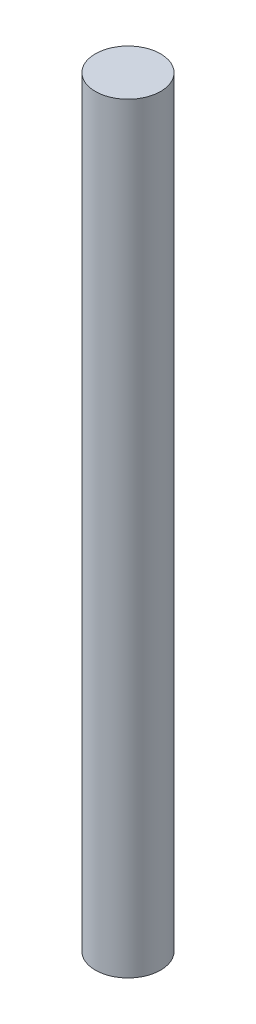
ISO-10303-21;
HEADER;
FILE_DESCRIPTION(('STEP AP214'),'2;1');
FILE_NAME('part.step','',(''),(''),'','','');
FILE_SCHEMA(('AUTOMOTIVE_DESIGN { 1 0 10303 214 1 1 1 1 }'));
ENDSEC;
DATA;
#1=APPLICATION_CONTEXT('core data for automotive mechanical design processes');
#2=APPLICATION_PROTOCOL_DEFINITION('international standard','automotive_design',2000,#1);
#3=PRODUCT_CONTEXT('',#1,'mechanical');
#4=PRODUCT('Part','Part','',(#3));
#5=PRODUCT_RELATED_PRODUCT_CATEGORY('part','',(#4));
#6=PRODUCT_DEFINITION_FORMATION('','',#4);
#7=PRODUCT_DEFINITION_CONTEXT('part definition',#1,'design');
#8=PRODUCT_DEFINITION('design','',#6,#7);
#9=PRODUCT_DEFINITION_SHAPE('','',#8);
#10=(LENGTH_UNIT() NAMED_UNIT(*) SI_UNIT(.MILLI.,.METRE.));
#11=(NAMED_UNIT(*) PLANE_ANGLE_UNIT() SI_UNIT($,.RADIAN.));
#12=(NAMED_UNIT(*) SI_UNIT($,.STERADIAN.) SOLID_ANGLE_UNIT());
#13=UNCERTAINTY_MEASURE_WITH_UNIT(LENGTH_MEASURE(1.E-05),#10,'distance_accuracy_value','');
#14=(GEOMETRIC_REPRESENTATION_CONTEXT(3) GLOBAL_UNCERTAINTY_ASSIGNED_CONTEXT((#13)) GLOBAL_UNIT_ASSIGNED_CONTEXT((#10,
#11,#12)) REPRESENTATION_CONTEXT('',''));
#15=CARTESIAN_POINT('',(0.,0.,0.));
#16=DIRECTION('',(0.,0.,1.));
#17=DIRECTION('',(1.,0.,0.));
#18=AXIS2_PLACEMENT_3D('',#15,#16,#17);
#19=CARTESIAN_POINT('',(0.,70.,0.));
#20=DIRECTION('',(0.,-1.,0.));
#21=DIRECTION('',(0.,0.,-1.));
#22=AXIS2_PLACEMENT_3D('',#19,#20,#21);
#23=CYLINDRICAL_SURFACE('',#22,3.);
#24=CARTESIAN_POINT('',(0.,70.,0.));
#25=DIRECTION('',(0.,1.,0.));
#26=DIRECTION('',(0.,0.,1.));
#27=AXIS2_PLACEMENT_3D('',#24,#25,#26);
#28=CIRCLE('',#27,3.);
#29=CARTESIAN_POINT('',(0.,70.,3.));
#30=VERTEX_POINT('',#29);
#31=EDGE_CURVE('E10',#30,#30,#28,.T.);
#32=ORIENTED_EDGE('',*,*,#31,.F.);
#33=EDGE_LOOP('',(#32));
#34=FACE_BOUND('',#33,.T.);
#35=CARTESIAN_POINT('',(0.,0.,0.));
#36=DIRECTION('',(0.,1.,0.));
#37=DIRECTION('',(0.,0.,1.));
#38=AXIS2_PLACEMENT_3D('',#35,#36,#37);
#39=CIRCLE('',#38,3.);
#40=CARTESIAN_POINT('',(0.,0.,3.));
#41=VERTEX_POINT('',#40);
#42=EDGE_CURVE('E32',#41,#41,#39,.T.);
#43=ORIENTED_EDGE('',*,*,#42,.T.);
#44=EDGE_LOOP('',(#43));
#45=FACE_BOUND('',#44,.T.);
#46=ADVANCED_FACE('F29',(#34,#45),#23,.T.);
#47=CARTESIAN_POINT('',(0.,70.,0.));
#48=DIRECTION('',(0.,1.,0.));
#49=DIRECTION('',(0.,0.,1.));
#50=AXIS2_PLACEMENT_3D('',#47,#48,#49);
#51=PLANE('',#50);
#52=ORIENTED_EDGE('',*,*,#31,.T.);
#53=EDGE_LOOP('',(#52));
#54=FACE_BOUND('',#53,.T.);
#55=ADVANCED_FACE('F44',(#54),#51,.T.);
#56=CARTESIAN_POINT('',(0.,0.,0.));
#57=DIRECTION('',(0.,1.,0.));
#58=DIRECTION('',(0.,0.,1.));
#59=AXIS2_PLACEMENT_3D('',#56,#57,#58);
#60=PLANE('',#59);
#61=ORIENTED_EDGE('',*,*,#42,.F.);
#62=EDGE_LOOP('',(#61));
#63=FACE_BOUND('',#62,.T.);
#64=ADVANCED_FACE('F42',(#63),#60,.F.);
#65=CLOSED_SHELL('',(#46,#55,#64));
#66=MANIFOLD_SOLID_BREP('B2',#65);
#67=ADVANCED_BREP_SHAPE_REPRESENTATION('',(#18,#66),#14);
#68=SHAPE_DEFINITION_REPRESENTATION(#9,#67);
ENDSEC;
END-ISO-10303-21;
